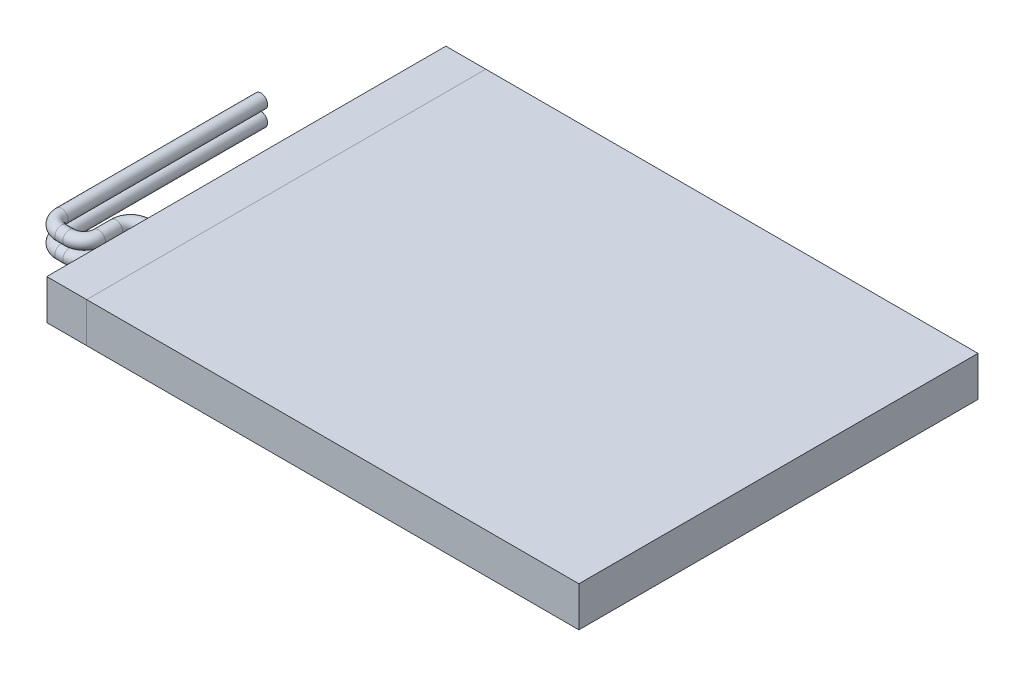
ISO-10303-21;
HEADER;
FILE_DESCRIPTION(('STEP AP214'),'2;1');
FILE_NAME('part.step','',(''),(''),'','','');
FILE_SCHEMA(('AUTOMOTIVE_DESIGN { 1 0 10303 214 1 1 1 1 }'));
ENDSEC;
DATA;
#1=APPLICATION_CONTEXT('core data for automotive mechanical design processes');
#2=APPLICATION_PROTOCOL_DEFINITION('international standard','automotive_design',2000,#1);
#3=PRODUCT_CONTEXT('',#1,'mechanical');
#4=PRODUCT('Part','Part','',(#3));
#5=PRODUCT_RELATED_PRODUCT_CATEGORY('part','',(#4));
#6=PRODUCT_DEFINITION_FORMATION('','',#4);
#7=PRODUCT_DEFINITION_CONTEXT('part definition',#1,'design');
#8=PRODUCT_DEFINITION('design','',#6,#7);
#9=PRODUCT_DEFINITION_SHAPE('','',#8);
#10=(LENGTH_UNIT() NAMED_UNIT(*) SI_UNIT(.MILLI.,.METRE.));
#11=(NAMED_UNIT(*) PLANE_ANGLE_UNIT() SI_UNIT($,.RADIAN.));
#12=(NAMED_UNIT(*) SI_UNIT($,.STERADIAN.) SOLID_ANGLE_UNIT());
#13=UNCERTAINTY_MEASURE_WITH_UNIT(LENGTH_MEASURE(1.E-05),#10,'distance_accuracy_value','');
#14=(GEOMETRIC_REPRESENTATION_CONTEXT(3) GLOBAL_UNCERTAINTY_ASSIGNED_CONTEXT((#13)) GLOBAL_UNIT_ASSIGNED_CONTEXT((#10,
#11,#12)) REPRESENTATION_CONTEXT('',''));
#15=CARTESIAN_POINT('',(0.,0.,0.));
#16=DIRECTION('',(0.,0.,1.));
#17=DIRECTION('',(1.,0.,0.));
#18=AXIS2_PLACEMENT_3D('',#15,#16,#17);
#19=CARTESIAN_POINT('',(-20.,-0.01,-15.));
#20=DIRECTION('',(-1.,0.,0.));
#21=DIRECTION('',(0.,0.,1.));
#22=AXIS2_PLACEMENT_3D('',#19,#20,#21);
#23=PLANE('',#22);
#24=CARTESIAN_POINT('',(-20.,1.2,7.5));
#25=DIRECTION('',(-1.,0.,0.));
#26=DIRECTION('',(0.,0.,1.));
#27=AXIS2_PLACEMENT_3D('',#24,#25,#26);
#28=CIRCLE('',#27,0.500000000000001);
#29=CARTESIAN_POINT('',(-20.,1.2,8.));
#30=VERTEX_POINT('',#29);
#31=EDGE_CURVE('E58',#30,#30,#28,.T.);
#32=ORIENTED_EDGE('',*,*,#31,.F.);
#33=EDGE_LOOP('',(#32));
#34=FACE_BOUND('',#33,.T.);
#35=ADVANCED_FACE('F55',(#34),#23,.F.);
#36=CARTESIAN_POINT('',(-24.,1.2,-5.1));
#37=DIRECTION('',(0.,0.,-1.));
#38=DIRECTION('',(-1.,0.,0.));
#39=AXIS2_PLACEMENT_3D('',#36,#37,#38);
#40=PLANE('',#39);
#41=CARTESIAN_POINT('',(-24.,1.2,-5.1));
#42=DIRECTION('',(0.,0.,-1.));
#43=DIRECTION('',(-1.,0.,0.));
#44=AXIS2_PLACEMENT_3D('',#41,#42,#43);
#45=CIRCLE('',#44,0.500000000000001);
#46=CARTESIAN_POINT('',(-24.5,1.2,-5.1));
#47=VERTEX_POINT('',#46);
#48=EDGE_CURVE('E80',#47,#47,#45,.T.);
#49=ORIENTED_EDGE('',*,*,#48,.T.);
#50=EDGE_LOOP('',(#49));
#51=FACE_BOUND('',#50,.T.);
#52=ADVANCED_FACE('F90',(#51),#40,.T.);
#53=CARTESIAN_POINT('',(-24.,1.2,9.9));
#54=DIRECTION('',(0.,0.,-1.));
#55=DIRECTION('',(-1.,0.,0.));
#56=AXIS2_PLACEMENT_3D('',#53,#54,#55);
#57=CYLINDRICAL_SURFACE('',#56,0.500000000000001);
#58=ORIENTED_EDGE('',*,*,#48,.F.);
#59=EDGE_LOOP('',(#58));
#60=FACE_BOUND('',#59,.T.);
#61=CARTESIAN_POINT('',(-24.,1.2,9.9));
#62=DIRECTION('',(0.,0.,-1.));
#63=DIRECTION('',(-1.,0.,0.));
#64=AXIS2_PLACEMENT_3D('',#61,#62,#63);
#65=CIRCLE('',#64,0.500000000000001);
#66=CARTESIAN_POINT('',(-24.5,1.2,9.9));
#67=VERTEX_POINT('',#66);
#68=EDGE_CURVE('E77',#67,#67,#65,.T.);
#69=ORIENTED_EDGE('',*,*,#68,.T.);
#70=EDGE_LOOP('',(#69));
#71=FACE_BOUND('',#70,.T.);
#72=ADVANCED_FACE('F94',(#60,#71),#57,.T.);
#73=CARTESIAN_POINT('',(-22.9,1.2,9.9));
#74=DIRECTION('',(0.,-1.,0.));
#75=DIRECTION('',(0.,0.,-1.));
#76=AXIS2_PLACEMENT_3D('',#73,#74,#75);
#77=TOROIDAL_SURFACE('',#76,1.1,0.500000000000001);
#78=CARTESIAN_POINT('',(-22.9,1.2,10.9999999999999));
#79=DIRECTION('',(-1.,0.,0.));
#80=DIRECTION('',(0.,0.,1.));
#81=AXIS2_PLACEMENT_3D('',#78,#79,#80);
#82=CIRCLE('',#81,0.500000000000001);
#83=CARTESIAN_POINT('',(-22.9,1.2,11.5));
#84=VERTEX_POINT('',#83);
#85=EDGE_CURVE('E74',#84,#84,#82,.T.);
#86=CARTESIAN_POINT('',(-22.9,1.2,9.9));
#87=DIRECTION('',(0.,-1.,0.));
#88=DIRECTION('',(0.,0.,-1.));
#89=AXIS2_PLACEMENT_3D('',#86,#87,#88);
#90=CIRCLE('',#89,1.6);
#91=EDGE_CURVE('',#84,#67,#90,.T.);
#92=ORIENTED_EDGE('',*,*,#85,.T.);
#93=ORIENTED_EDGE('',*,*,#68,.F.);
#94=ORIENTED_EDGE('',*,*,#91,.T.);
#95=ORIENTED_EDGE('',*,*,#91,.F.);
#96=EDGE_LOOP('',(#92,#94,#93,#95));
#97=FACE_BOUND('',#96,.T.);
#98=ADVANCED_FACE('F99',(#97),#77,.T.);
#99=CARTESIAN_POINT('',(-22.3,1.2,10.9999999999999));
#100=DIRECTION('',(-1.,0.,0.));
#101=DIRECTION('',(0.,0.,1.));
#102=AXIS2_PLACEMENT_3D('',#99,#100,#101);
#103=CYLINDRICAL_SURFACE('',#102,0.500000000000001);
#104=ORIENTED_EDGE('',*,*,#85,.F.);
#105=EDGE_LOOP('',(#104));
#106=FACE_BOUND('',#105,.T.);
#107=CARTESIAN_POINT('',(-22.3,1.2,11.));
#108=DIRECTION('',(-1.,0.,0.));
#109=DIRECTION('',(0.,0.,1.));
#110=AXIS2_PLACEMENT_3D('',#107,#108,#109);
#111=CIRCLE('',#110,0.500000000000001);
#112=CARTESIAN_POINT('',(-22.3,1.2,11.5));
#113=VERTEX_POINT('',#112);
#114=EDGE_CURVE('E71',#113,#113,#111,.T.);
#115=ORIENTED_EDGE('',*,*,#114,.T.);
#116=EDGE_LOOP('',(#115));
#117=FACE_BOUND('',#116,.T.);
#118=ADVANCED_FACE('F105',(#106,#117),#103,.T.);
#119=CARTESIAN_POINT('',(-22.3,1.2,9.9));
#120=DIRECTION('',(0.,-1.,0.));
#121=DIRECTION('',(0.,0.,-1.));
#122=AXIS2_PLACEMENT_3D('',#119,#120,#121);
#123=TOROIDAL_SURFACE('',#122,1.1,0.500000000000001);
#124=CARTESIAN_POINT('',(-21.2,1.2,9.9));
#125=DIRECTION('',(0.,0.,1.));
#126=DIRECTION('',(1.,0.,0.));
#127=AXIS2_PLACEMENT_3D('',#124,#125,#126);
#128=CIRCLE('',#127,0.500000000000001);
#129=CARTESIAN_POINT('',(-20.7,1.2,9.9));
#130=VERTEX_POINT('',#129);
#131=EDGE_CURVE('E66',#130,#130,#128,.T.);
#132=CARTESIAN_POINT('',(-22.3,1.2,9.9));
#133=DIRECTION('',(0.,-1.,0.));
#134=DIRECTION('',(0.,0.,-1.));
#135=AXIS2_PLACEMENT_3D('',#132,#133,#134);
#136=CIRCLE('',#135,1.6);
#137=EDGE_CURVE('',#130,#113,#136,.T.);
#138=ORIENTED_EDGE('',*,*,#131,.T.);
#139=ORIENTED_EDGE('',*,*,#114,.F.);
#140=ORIENTED_EDGE('',*,*,#137,.T.);
#141=ORIENTED_EDGE('',*,*,#137,.F.);
#142=EDGE_LOOP('',(#138,#140,#139,#141));
#143=FACE_BOUND('',#142,.T.);
#144=ADVANCED_FACE('F109',(#143),#123,.T.);
#145=CARTESIAN_POINT('',(-21.2,1.2,8.6));
#146=DIRECTION('',(0.,0.,1.));
#147=DIRECTION('',(1.,0.,0.));
#148=AXIS2_PLACEMENT_3D('',#145,#146,#147);
#149=CYLINDRICAL_SURFACE('',#148,0.500000000000001);
#150=ORIENTED_EDGE('',*,*,#131,.F.);
#151=EDGE_LOOP('',(#150));
#152=FACE_BOUND('',#151,.T.);
#153=CARTESIAN_POINT('',(-21.2,1.2,8.6));
#154=DIRECTION('',(0.,0.,1.));
#155=DIRECTION('',(1.,0.,0.));
#156=AXIS2_PLACEMENT_3D('',#153,#154,#155);
#157=CIRCLE('',#156,0.500000000000001);
#158=CARTESIAN_POINT('',(-21.7,1.2,8.6));
#159=VERTEX_POINT('',#158);
#160=EDGE_CURVE('E62',#159,#159,#157,.T.);
#161=ORIENTED_EDGE('',*,*,#160,.T.);
#162=EDGE_LOOP('',(#161));
#163=FACE_BOUND('',#162,.T.);
#164=ADVANCED_FACE('F113',(#152,#163),#149,.T.);
#165=CARTESIAN_POINT('',(-20.1,1.2,8.6));
#166=DIRECTION('',(0.,1.,0.));
#167=DIRECTION('',(0.,0.,1.));
#168=AXIS2_PLACEMENT_3D('',#165,#166,#167);
#169=TOROIDAL_SURFACE('',#168,1.1,0.500000000000001);
#170=CARTESIAN_POINT('',(-20.1,1.2,7.5));
#171=DIRECTION('',(-1.,0.,0.));
#172=DIRECTION('',(0.,0.,1.));
#173=AXIS2_PLACEMENT_3D('',#170,#171,#172);
#174=CIRCLE('',#173,0.500000000000001);
#175=CARTESIAN_POINT('',(-20.1,1.2,7.));
#176=VERTEX_POINT('',#175);
#177=EDGE_CURVE('E13',#176,#176,#174,.T.);
#178=CARTESIAN_POINT('',(-20.1,1.2,8.6));
#179=DIRECTION('',(0.,1.,0.));
#180=DIRECTION('',(0.,0.,1.));
#181=AXIS2_PLACEMENT_3D('',#178,#179,#180);
#182=CIRCLE('',#181,1.6);
#183=EDGE_CURVE('',#176,#159,#182,.T.);
#184=ORIENTED_EDGE('',*,*,#177,.T.);
#185=ORIENTED_EDGE('',*,*,#160,.F.);
#186=ORIENTED_EDGE('',*,*,#183,.T.);
#187=ORIENTED_EDGE('',*,*,#183,.F.);
#188=EDGE_LOOP('',(#184,#186,#185,#187));
#189=FACE_BOUND('',#188,.T.);
#190=ADVANCED_FACE('F117',(#189),#169,.T.);
#191=CARTESIAN_POINT('',(-20.,1.2,7.5));
#192=DIRECTION('',(-1.,0.,0.));
#193=DIRECTION('',(0.,0.,1.));
#194=AXIS2_PLACEMENT_3D('',#191,#192,#193);
#195=CYLINDRICAL_SURFACE('',#194,0.500000000000001);
#196=ORIENTED_EDGE('',*,*,#177,.F.);
#197=EDGE_LOOP('',(#196));
#198=FACE_BOUND('',#197,.T.);
#199=ORIENTED_EDGE('',*,*,#31,.T.);
#200=EDGE_LOOP('',(#199));
#201=FACE_BOUND('',#200,.T.);
#202=ADVANCED_FACE('F87',(#198,#201),#195,.T.);
#203=CLOSED_SHELL('',(#35,#52,#72,#98,#118,#144,#164,#190,#202));
#204=MANIFOLD_SOLID_BREP('B2',#203);
#205=CARTESIAN_POINT('',(-20.,-0.01,-15.));
#206=DIRECTION('',(-1.,0.,0.));
#207=DIRECTION('',(0.,0.,1.));
#208=AXIS2_PLACEMENT_3D('',#205,#206,#207);
#209=PLANE('',#208);
#210=CARTESIAN_POINT('',(-20.,2.4,7.5));
#211=DIRECTION('',(-1.,0.,0.));
#212=DIRECTION('',(0.,0.,1.));
#213=AXIS2_PLACEMENT_3D('',#210,#211,#212);
#214=CIRCLE('',#213,0.5);
#215=CARTESIAN_POINT('',(-20.,2.4,8.));
#216=VERTEX_POINT('',#215);
#217=EDGE_CURVE('E54',#216,#216,#214,.T.);
#218=ORIENTED_EDGE('',*,*,#217,.F.);
#219=EDGE_LOOP('',(#218));
#220=FACE_BOUND('',#219,.T.);
#221=ADVANCED_FACE('F201',(#220),#209,.F.);
#222=CARTESIAN_POINT('',(-24.,2.4,-5.1));
#223=DIRECTION('',(0.,0.,-1.));
#224=DIRECTION('',(-1.,0.,0.));
#225=AXIS2_PLACEMENT_3D('',#222,#223,#224);
#226=PLANE('',#225);
#227=CARTESIAN_POINT('',(-24.,2.4,-5.1));
#228=DIRECTION('',(0.,0.,-1.));
#229=DIRECTION('',(-1.,0.,0.));
#230=AXIS2_PLACEMENT_3D('',#227,#228,#229);
#231=CIRCLE('',#230,0.5);
#232=CARTESIAN_POINT('',(-24.5,2.4,-5.1));
#233=VERTEX_POINT('',#232);
#234=EDGE_CURVE('E229',#233,#233,#231,.T.);
#235=ORIENTED_EDGE('',*,*,#234,.T.);
#236=EDGE_LOOP('',(#235));
#237=FACE_BOUND('',#236,.T.);
#238=ADVANCED_FACE('F233',(#237),#226,.T.);
#239=CARTESIAN_POINT('',(-24.,2.4,9.9));
#240=DIRECTION('',(0.,0.,-1.));
#241=DIRECTION('',(-1.,0.,0.));
#242=AXIS2_PLACEMENT_3D('',#239,#240,#241);
#243=CYLINDRICAL_SURFACE('',#242,0.5);
#244=ORIENTED_EDGE('',*,*,#234,.F.);
#245=EDGE_LOOP('',(#244));
#246=FACE_BOUND('',#245,.T.);
#247=CARTESIAN_POINT('',(-24.,2.4,9.9));
#248=DIRECTION('',(0.,0.,-1.));
#249=DIRECTION('',(-1.,0.,0.));
#250=AXIS2_PLACEMENT_3D('',#247,#248,#249);
#251=CIRCLE('',#250,0.5);
#252=CARTESIAN_POINT('',(-24.5,2.4,9.9));
#253=VERTEX_POINT('',#252);
#254=EDGE_CURVE('E226',#253,#253,#251,.T.);
#255=ORIENTED_EDGE('',*,*,#254,.T.);
#256=EDGE_LOOP('',(#255));
#257=FACE_BOUND('',#256,.T.);
#258=ADVANCED_FACE('F235',(#246,#257),#243,.T.);
#259=CARTESIAN_POINT('',(-22.9,2.4,9.9));
#260=DIRECTION('',(0.,-1.,0.));
#261=DIRECTION('',(0.,0.,-1.));
#262=AXIS2_PLACEMENT_3D('',#259,#260,#261);
#263=TOROIDAL_SURFACE('',#262,1.1,0.5);
#264=CARTESIAN_POINT('',(-22.9,2.4,11.));
#265=DIRECTION('',(-1.,0.,0.));
#266=DIRECTION('',(0.,0.,1.));
#267=AXIS2_PLACEMENT_3D('',#264,#265,#266);
#268=CIRCLE('',#267,0.5);
#269=CARTESIAN_POINT('',(-22.9,2.4,11.5));
#270=VERTEX_POINT('',#269);
#271=EDGE_CURVE('E223',#270,#270,#268,.T.);
#272=CARTESIAN_POINT('',(-22.9,2.4,9.9));
#273=DIRECTION('',(0.,-1.,0.));
#274=DIRECTION('',(0.,0.,-1.));
#275=AXIS2_PLACEMENT_3D('',#272,#273,#274);
#276=CIRCLE('',#275,1.6);
#277=EDGE_CURVE('',#270,#253,#276,.T.);
#278=ORIENTED_EDGE('',*,*,#271,.T.);
#279=ORIENTED_EDGE('',*,*,#254,.F.);
#280=ORIENTED_EDGE('',*,*,#277,.T.);
#281=ORIENTED_EDGE('',*,*,#277,.F.);
#282=EDGE_LOOP('',(#278,#280,#279,#281));
#283=FACE_BOUND('',#282,.T.);
#284=ADVANCED_FACE('F238',(#283),#263,.T.);
#285=CARTESIAN_POINT('',(-22.3,2.4,11.));
#286=DIRECTION('',(-1.,0.,0.));
#287=DIRECTION('',(0.,0.,1.));
#288=AXIS2_PLACEMENT_3D('',#285,#286,#287);
#289=CYLINDRICAL_SURFACE('',#288,0.5);
#290=ORIENTED_EDGE('',*,*,#271,.F.);
#291=EDGE_LOOP('',(#290));
#292=FACE_BOUND('',#291,.T.);
#293=CARTESIAN_POINT('',(-22.3,2.4,11.));
#294=DIRECTION('',(-1.,0.,0.));
#295=DIRECTION('',(0.,0.,1.));
#296=AXIS2_PLACEMENT_3D('',#293,#294,#295);
#297=CIRCLE('',#296,0.5);
#298=CARTESIAN_POINT('',(-22.3,2.4,11.5));
#299=VERTEX_POINT('',#298);
#300=EDGE_CURVE('E220',#299,#299,#297,.T.);
#301=ORIENTED_EDGE('',*,*,#300,.T.);
#302=EDGE_LOOP('',(#301));
#303=FACE_BOUND('',#302,.T.);
#304=ADVANCED_FACE('F244',(#292,#303),#289,.T.);
#305=CARTESIAN_POINT('',(-22.3,2.4,9.9));
#306=DIRECTION('',(0.,-1.,0.));
#307=DIRECTION('',(0.,0.,-1.));
#308=AXIS2_PLACEMENT_3D('',#305,#306,#307);
#309=TOROIDAL_SURFACE('',#308,1.1,0.5);
#310=CARTESIAN_POINT('',(-21.2,2.4,9.9));
#311=DIRECTION('',(0.,0.,1.));
#312=DIRECTION('',(1.,0.,0.));
#313=AXIS2_PLACEMENT_3D('',#310,#311,#312);
#314=CIRCLE('',#313,0.5);
#315=CARTESIAN_POINT('',(-20.7,2.4,9.9));
#316=VERTEX_POINT('',#315);
#317=EDGE_CURVE('E215',#316,#316,#314,.T.);
#318=CARTESIAN_POINT('',(-22.3,2.4,9.9));
#319=DIRECTION('',(0.,-1.,0.));
#320=DIRECTION('',(0.,0.,-1.));
#321=AXIS2_PLACEMENT_3D('',#318,#319,#320);
#322=CIRCLE('',#321,1.6);
#323=EDGE_CURVE('',#316,#299,#322,.T.);
#324=ORIENTED_EDGE('',*,*,#317,.T.);
#325=ORIENTED_EDGE('',*,*,#300,.F.);
#326=ORIENTED_EDGE('',*,*,#323,.T.);
#327=ORIENTED_EDGE('',*,*,#323,.F.);
#328=EDGE_LOOP('',(#324,#326,#325,#327));
#329=FACE_BOUND('',#328,.T.);
#330=ADVANCED_FACE('F250',(#329),#309,.T.);
#331=CARTESIAN_POINT('',(-21.2,2.4,8.6));
#332=DIRECTION('',(0.,0.,1.));
#333=DIRECTION('',(1.,0.,0.));
#334=AXIS2_PLACEMENT_3D('',#331,#332,#333);
#335=CYLINDRICAL_SURFACE('',#334,0.5);
#336=ORIENTED_EDGE('',*,*,#317,.F.);
#337=EDGE_LOOP('',(#336));
#338=FACE_BOUND('',#337,.T.);
#339=CARTESIAN_POINT('',(-21.2,2.4,8.6));
#340=DIRECTION('',(0.,0.,1.));
#341=DIRECTION('',(1.,0.,0.));
#342=AXIS2_PLACEMENT_3D('',#339,#340,#341);
#343=CIRCLE('',#342,0.5);
#344=CARTESIAN_POINT('',(-21.7,2.4,8.6));
#345=VERTEX_POINT('',#344);
#346=EDGE_CURVE('E211',#345,#345,#343,.T.);
#347=ORIENTED_EDGE('',*,*,#346,.T.);
#348=EDGE_LOOP('',(#347));
#349=FACE_BOUND('',#348,.T.);
#350=ADVANCED_FACE('F256',(#338,#349),#335,.T.);
#351=CARTESIAN_POINT('',(-20.1,2.4,8.6));
#352=DIRECTION('',(0.,1.,0.));
#353=DIRECTION('',(0.,0.,1.));
#354=AXIS2_PLACEMENT_3D('',#351,#352,#353);
#355=TOROIDAL_SURFACE('',#354,1.1,0.5);
#356=CARTESIAN_POINT('',(-20.1,2.4,7.5));
#357=DIRECTION('',(-1.,0.,0.));
#358=DIRECTION('',(0.,0.,1.));
#359=AXIS2_PLACEMENT_3D('',#356,#357,#358);
#360=CIRCLE('',#359,0.5);
#361=CARTESIAN_POINT('',(-20.1,2.4,7.));
#362=VERTEX_POINT('',#361);
#363=EDGE_CURVE('E207',#362,#362,#360,.T.);
#364=CARTESIAN_POINT('',(-20.1,2.4,8.6));
#365=DIRECTION('',(0.,1.,0.));
#366=DIRECTION('',(0.,0.,1.));
#367=AXIS2_PLACEMENT_3D('',#364,#365,#366);
#368=CIRCLE('',#367,1.6);
#369=EDGE_CURVE('',#362,#345,#368,.T.);
#370=ORIENTED_EDGE('',*,*,#363,.T.);
#371=ORIENTED_EDGE('',*,*,#346,.F.);
#372=ORIENTED_EDGE('',*,*,#369,.T.);
#373=ORIENTED_EDGE('',*,*,#369,.F.);
#374=EDGE_LOOP('',(#370,#372,#371,#373));
#375=FACE_BOUND('',#374,.T.);
#376=ADVANCED_FACE('F262',(#375),#355,.T.);
#377=CARTESIAN_POINT('',(-20.,2.4,7.5));
#378=DIRECTION('',(-1.,0.,0.));
#379=DIRECTION('',(0.,0.,1.));
#380=AXIS2_PLACEMENT_3D('',#377,#378,#379);
#381=CYLINDRICAL_SURFACE('',#380,0.5);
#382=ORIENTED_EDGE('',*,*,#363,.F.);
#383=EDGE_LOOP('',(#382));
#384=FACE_BOUND('',#383,.T.);
#385=ORIENTED_EDGE('',*,*,#217,.T.);
#386=EDGE_LOOP('',(#385));
#387=FACE_BOUND('',#386,.T.);
#388=ADVANCED_FACE('F267',(#384,#387),#381,.T.);
#389=CLOSED_SHELL('',(#221,#238,#258,#284,#304,#330,#350,#376,#388));
#390=MANIFOLD_SOLID_BREP('B8',#389);
#391=CARTESIAN_POINT('',(-20.,-0.01,-15.));
#392=DIRECTION('',(-1.,0.,0.));
#393=DIRECTION('',(0.,0.,1.));
#394=AXIS2_PLACEMENT_3D('',#391,#392,#393);
#395=PLANE('',#394);
#396=DIRECTION('',(0.,0.,1.));
#397=VECTOR('',#396,1.);
#398=CARTESIAN_POINT('',(-20.,0.,-15.));
#399=LINE('',#398,#397);
#400=CARTESIAN_POINT('',(-20.,0.,-15.));
#401=VERTEX_POINT('',#400);
#402=CARTESIAN_POINT('',(-20.,0.,15.));
#403=VERTEX_POINT('',#402);
#404=EDGE_CURVE('E199',#401,#403,#399,.T.);
#405=ORIENTED_EDGE('',*,*,#404,.T.);
#406=DIRECTION('',(0.,-1.,0.));
#407=VECTOR('',#406,1.);
#408=CARTESIAN_POINT('',(-20.,3.,15.));
#409=LINE('',#408,#407);
#410=CARTESIAN_POINT('',(-20.,3.,15.));
#411=VERTEX_POINT('',#410);
#412=EDGE_CURVE('E409',#411,#403,#409,.T.);
#413=ORIENTED_EDGE('',*,*,#412,.F.);
#414=DIRECTION('',(0.,0.,1.));
#415=VECTOR('',#414,1.);
#416=CARTESIAN_POINT('',(-20.,3.,-15.));
#417=LINE('',#416,#415);
#418=CARTESIAN_POINT('',(-20.,3.,-15.));
#419=VERTEX_POINT('',#418);
#420=EDGE_CURVE('E391',#419,#411,#417,.T.);
#421=ORIENTED_EDGE('',*,*,#420,.F.);
#422=DIRECTION('',(0.,-1.,0.));
#423=VECTOR('',#422,1.);
#424=CARTESIAN_POINT('',(-20.,3.,-15.));
#425=LINE('',#424,#423);
#426=EDGE_CURVE('E402',#419,#401,#425,.T.);
#427=ORIENTED_EDGE('',*,*,#426,.T.);
#428=EDGE_LOOP('',(#405,#413,#421,#427));
#429=FACE_BOUND('',#428,.T.);
#430=ADVANCED_FACE('F340',(#429),#395,.T.);
#431=CARTESIAN_POINT('',(-17.,-0.01,-15.));
#432=DIRECTION('',(1.,0.,0.));
#433=DIRECTION('',(0.,0.,-1.));
#434=AXIS2_PLACEMENT_3D('',#431,#432,#433);
#435=PLANE('',#434);
#436=DIRECTION('',(0.,-1.,0.));
#437=VECTOR('',#436,1.);
#438=CARTESIAN_POINT('',(-17.,3.,15.));
#439=LINE('',#438,#437);
#440=CARTESIAN_POINT('',(-17.,3.,15.));
#441=VERTEX_POINT('',#440);
#442=CARTESIAN_POINT('',(-17.,0.,15.));
#443=VERTEX_POINT('',#442);
#444=EDGE_CURVE('E394',#441,#443,#439,.T.);
#445=ORIENTED_EDGE('',*,*,#444,.T.);
#446=DIRECTION('',(0.,0.,-1.));
#447=VECTOR('',#446,1.);
#448=CARTESIAN_POINT('',(-17.,0.,0.));
#449=LINE('',#448,#447);
#450=CARTESIAN_POINT('',(-17.,0.,-15.));
#451=VERTEX_POINT('',#450);
#452=EDGE_CURVE('E388',#443,#451,#449,.T.);
#453=ORIENTED_EDGE('',*,*,#452,.T.);
#454=DIRECTION('',(0.,1.,0.));
#455=VECTOR('',#454,1.);
#456=CARTESIAN_POINT('',(-17.,-0.01,-15.));
#457=LINE('',#456,#455);
#458=CARTESIAN_POINT('',(-17.,3.,-15.));
#459=VERTEX_POINT('',#458);
#460=EDGE_CURVE('E392',#451,#459,#457,.T.);
#461=ORIENTED_EDGE('',*,*,#460,.T.);
#462=DIRECTION('',(0.,0.,-1.));
#463=VECTOR('',#462,1.);
#464=CARTESIAN_POINT('',(-17.,3.,0.));
#465=LINE('',#464,#463);
#466=EDGE_CURVE('E376',#441,#459,#465,.T.);
#467=ORIENTED_EDGE('',*,*,#466,.F.);
#468=EDGE_LOOP('',(#445,#453,#461,#467));
#469=FACE_BOUND('',#468,.T.);
#470=ADVANCED_FACE('F396',(#469),#435,.T.);
#471=CARTESIAN_POINT('',(0.,0.,0.));
#472=DIRECTION('',(0.,1.,0.));
#473=DIRECTION('',(0.,0.,1.));
#474=AXIS2_PLACEMENT_3D('',#471,#472,#473);
#475=PLANE('',#474);
#476=ORIENTED_EDGE('',*,*,#452,.F.);
#477=DIRECTION('',(1.,0.,0.));
#478=VECTOR('',#477,1.);
#479=CARTESIAN_POINT('',(-20.,0.,15.));
#480=LINE('',#479,#478);
#481=EDGE_CURVE('E343',#403,#443,#480,.T.);
#482=ORIENTED_EDGE('',*,*,#481,.F.);
#483=ORIENTED_EDGE('',*,*,#404,.F.);
#484=DIRECTION('',(-1.,0.,0.));
#485=VECTOR('',#484,1.);
#486=CARTESIAN_POINT('',(-20.,0.,-15.));
#487=LINE('',#486,#485);
#488=EDGE_CURVE('E384',#451,#401,#487,.T.);
#489=ORIENTED_EDGE('',*,*,#488,.F.);
#490=EDGE_LOOP('',(#476,#482,#483,#489));
#491=FACE_BOUND('',#490,.T.);
#492=ADVANCED_FACE('F386',(#491),#475,.F.);
#493=CARTESIAN_POINT('',(-20.,3.,-15.));
#494=DIRECTION('',(0.,0.,1.));
#495=DIRECTION('',(1.,0.,0.));
#496=AXIS2_PLACEMENT_3D('',#493,#494,#495);
#497=PLANE('',#496);
#498=ORIENTED_EDGE('',*,*,#460,.F.);
#499=ORIENTED_EDGE('',*,*,#488,.T.);
#500=ORIENTED_EDGE('',*,*,#426,.F.);
#501=DIRECTION('',(-1.,0.,0.));
#502=VECTOR('',#501,1.);
#503=CARTESIAN_POINT('',(-20.,3.,-15.));
#504=LINE('',#503,#502);
#505=EDGE_CURVE('E368',#459,#419,#504,.T.);
#506=ORIENTED_EDGE('',*,*,#505,.F.);
#507=EDGE_LOOP('',(#498,#499,#500,#506));
#508=FACE_BOUND('',#507,.T.);
#509=ADVANCED_FACE('F393',(#508),#497,.F.);
#510=CARTESIAN_POINT('',(-20.,3.,15.));
#511=DIRECTION('',(0.,0.,-1.));
#512=DIRECTION('',(-1.,0.,0.));
#513=AXIS2_PLACEMENT_3D('',#510,#511,#512);
#514=PLANE('',#513);
#515=ORIENTED_EDGE('',*,*,#444,.F.);
#516=DIRECTION('',(1.,0.,0.));
#517=VECTOR('',#516,1.);
#518=CARTESIAN_POINT('',(-20.,3.,15.));
#519=LINE('',#518,#517);
#520=EDGE_CURVE('E401',#411,#441,#519,.T.);
#521=ORIENTED_EDGE('',*,*,#520,.F.);
#522=ORIENTED_EDGE('',*,*,#412,.T.);
#523=ORIENTED_EDGE('',*,*,#481,.T.);
#524=EDGE_LOOP('',(#515,#521,#522,#523));
#525=FACE_BOUND('',#524,.T.);
#526=ADVANCED_FACE('F420',(#525),#514,.F.);
#527=CARTESIAN_POINT('',(0.,3.,0.));
#528=DIRECTION('',(0.,1.,0.));
#529=DIRECTION('',(0.,0.,1.));
#530=AXIS2_PLACEMENT_3D('',#527,#528,#529);
#531=PLANE('',#530);
#532=ORIENTED_EDGE('',*,*,#520,.T.);
#533=ORIENTED_EDGE('',*,*,#466,.T.);
#534=ORIENTED_EDGE('',*,*,#505,.T.);
#535=ORIENTED_EDGE('',*,*,#420,.T.);
#536=EDGE_LOOP('',(#532,#533,#534,#535));
#537=FACE_BOUND('',#536,.T.);
#538=ADVANCED_FACE('F418',(#537),#531,.T.);
#539=CLOSED_SHELL('',(#430,#470,#492,#509,#526,#538));
#540=MANIFOLD_SOLID_BREP('B49',#539);
#541=CARTESIAN_POINT('',(-17.,-0.01,-15.));
#542=DIRECTION('',(1.,0.,0.));
#543=DIRECTION('',(0.,0.,-1.));
#544=AXIS2_PLACEMENT_3D('',#541,#542,#543);
#545=PLANE('',#544);
#546=DIRECTION('',(0.,-1.,0.));
#547=VECTOR('',#546,1.);
#548=CARTESIAN_POINT('',(-17.,3.,15.));
#549=LINE('',#548,#547);
#550=CARTESIAN_POINT('',(-17.,3.,15.));
#551=VERTEX_POINT('',#550);
#552=CARTESIAN_POINT('',(-17.,0.,15.));
#553=VERTEX_POINT('',#552);
#554=EDGE_CURVE('E477',#551,#553,#549,.T.);
#555=ORIENTED_EDGE('',*,*,#554,.F.);
#556=DIRECTION('',(0.,0.,-1.));
#557=VECTOR('',#556,1.);
#558=CARTESIAN_POINT('',(-17.,3.,0.));
#559=LINE('',#558,#557);
#560=CARTESIAN_POINT('',(-17.,3.,-15.));
#561=VERTEX_POINT('',#560);
#562=EDGE_CURVE('E338',#551,#561,#559,.T.);
#563=ORIENTED_EDGE('',*,*,#562,.T.);
#564=DIRECTION('',(0.,1.,0.));
#565=VECTOR('',#564,1.);
#566=CARTESIAN_POINT('',(-17.,-0.01,-15.));
#567=LINE('',#566,#565);
#568=CARTESIAN_POINT('',(-17.,0.,-15.));
#569=VERTEX_POINT('',#568);
#570=EDGE_CURVE('E472',#569,#561,#567,.T.);
#571=ORIENTED_EDGE('',*,*,#570,.F.);
#572=DIRECTION('',(0.,0.,-1.));
#573=VECTOR('',#572,1.);
#574=CARTESIAN_POINT('',(-17.,0.,0.));
#575=LINE('',#574,#573);
#576=EDGE_CURVE('E525',#553,#569,#575,.T.);
#577=ORIENTED_EDGE('',*,*,#576,.F.);
#578=EDGE_LOOP('',(#555,#563,#571,#577));
#579=FACE_BOUND('',#578,.T.);
#580=ADVANCED_FACE('F469',(#579),#545,.F.);
#581=CARTESIAN_POINT('',(20.,3.,-15.));
#582=DIRECTION('',(-1.,0.,0.));
#583=DIRECTION('',(0.,0.,1.));
#584=AXIS2_PLACEMENT_3D('',#581,#582,#583);
#585=PLANE('',#584);
#586=DIRECTION('',(0.,0.,-1.));
#587=VECTOR('',#586,1.);
#588=CARTESIAN_POINT('',(20.,0.,-15.));
#589=LINE('',#588,#587);
#590=CARTESIAN_POINT('',(20.,0.,15.));
#591=VERTEX_POINT('',#590);
#592=CARTESIAN_POINT('',(20.,0.,-15.));
#593=VERTEX_POINT('',#592);
#594=EDGE_CURVE('E535',#591,#593,#589,.T.);
#595=ORIENTED_EDGE('',*,*,#594,.T.);
#596=DIRECTION('',(0.,-1.,0.));
#597=VECTOR('',#596,1.);
#598=CARTESIAN_POINT('',(20.,3.,-15.));
#599=LINE('',#598,#597);
#600=CARTESIAN_POINT('',(20.,3.,-15.));
#601=VERTEX_POINT('',#600);
#602=EDGE_CURVE('E526',#601,#593,#599,.T.);
#603=ORIENTED_EDGE('',*,*,#602,.F.);
#604=DIRECTION('',(0.,0.,-1.));
#605=VECTOR('',#604,1.);
#606=CARTESIAN_POINT('',(20.,3.,-15.));
#607=LINE('',#606,#605);
#608=CARTESIAN_POINT('',(20.,3.,15.));
#609=VERTEX_POINT('',#608);
#610=EDGE_CURVE('E512',#609,#601,#607,.T.);
#611=ORIENTED_EDGE('',*,*,#610,.F.);
#612=DIRECTION('',(0.,-1.,0.));
#613=VECTOR('',#612,1.);
#614=CARTESIAN_POINT('',(20.,3.,15.));
#615=LINE('',#614,#613);
#616=EDGE_CURVE('E519',#609,#591,#615,.T.);
#617=ORIENTED_EDGE('',*,*,#616,.T.);
#618=EDGE_LOOP('',(#595,#603,#611,#617));
#619=FACE_BOUND('',#618,.T.);
#620=ADVANCED_FACE('F528',(#619),#585,.F.);
#621=CARTESIAN_POINT('',(-20.,3.,-15.));
#622=DIRECTION('',(0.,0.,1.));
#623=DIRECTION('',(1.,0.,0.));
#624=AXIS2_PLACEMENT_3D('',#621,#622,#623);
#625=PLANE('',#624);
#626=DIRECTION('',(-1.,0.,0.));
#627=VECTOR('',#626,1.);
#628=CARTESIAN_POINT('',(-20.,0.,-15.));
#629=LINE('',#628,#627);
#630=EDGE_CURVE('E516',#593,#569,#629,.T.);
#631=ORIENTED_EDGE('',*,*,#630,.T.);
#632=ORIENTED_EDGE('',*,*,#570,.T.);
#633=DIRECTION('',(-1.,0.,0.));
#634=VECTOR('',#633,1.);
#635=CARTESIAN_POINT('',(-20.,3.,-15.));
#636=LINE('',#635,#634);
#637=EDGE_CURVE('E530',#601,#561,#636,.T.);
#638=ORIENTED_EDGE('',*,*,#637,.F.);
#639=ORIENTED_EDGE('',*,*,#602,.T.);
#640=EDGE_LOOP('',(#631,#632,#638,#639));
#641=FACE_BOUND('',#640,.T.);
#642=ADVANCED_FACE('F543',(#641),#625,.F.);
#643=CARTESIAN_POINT('',(-20.,3.,15.));
#644=DIRECTION('',(0.,0.,-1.));
#645=DIRECTION('',(-1.,0.,0.));
#646=AXIS2_PLACEMENT_3D('',#643,#644,#645);
#647=PLANE('',#646);
#648=DIRECTION('',(1.,0.,0.));
#649=VECTOR('',#648,1.);
#650=CARTESIAN_POINT('',(-20.,3.,15.));
#651=LINE('',#650,#649);
#652=EDGE_CURVE('E508',#551,#609,#651,.T.);
#653=ORIENTED_EDGE('',*,*,#652,.F.);
#654=ORIENTED_EDGE('',*,*,#554,.T.);
#655=DIRECTION('',(1.,0.,0.));
#656=VECTOR('',#655,1.);
#657=CARTESIAN_POINT('',(-20.,0.,15.));
#658=LINE('',#657,#656);
#659=EDGE_CURVE('E522',#553,#591,#658,.T.);
#660=ORIENTED_EDGE('',*,*,#659,.T.);
#661=ORIENTED_EDGE('',*,*,#616,.F.);
#662=EDGE_LOOP('',(#653,#654,#660,#661));
#663=FACE_BOUND('',#662,.T.);
#664=ADVANCED_FACE('F520',(#663),#647,.F.);
#665=CARTESIAN_POINT('',(0.,0.,0.));
#666=DIRECTION('',(0.,1.,0.));
#667=DIRECTION('',(0.,0.,1.));
#668=AXIS2_PLACEMENT_3D('',#665,#666,#667);
#669=PLANE('',#668);
#670=ORIENTED_EDGE('',*,*,#659,.F.);
#671=ORIENTED_EDGE('',*,*,#576,.T.);
#672=ORIENTED_EDGE('',*,*,#630,.F.);
#673=ORIENTED_EDGE('',*,*,#594,.F.);
#674=EDGE_LOOP('',(#670,#671,#672,#673));
#675=FACE_BOUND('',#674,.T.);
#676=ADVANCED_FACE('F541',(#675),#669,.F.);
#677=CARTESIAN_POINT('',(0.,3.,0.));
#678=DIRECTION('',(0.,1.,0.));
#679=DIRECTION('',(0.,0.,1.));
#680=AXIS2_PLACEMENT_3D('',#677,#678,#679);
#681=PLANE('',#680);
#682=ORIENTED_EDGE('',*,*,#562,.F.);
#683=ORIENTED_EDGE('',*,*,#652,.T.);
#684=ORIENTED_EDGE('',*,*,#610,.T.);
#685=ORIENTED_EDGE('',*,*,#637,.T.);
#686=EDGE_LOOP('',(#682,#683,#684,#685));
#687=FACE_BOUND('',#686,.T.);
#688=ADVANCED_FACE('F510',(#687),#681,.T.);
#689=CLOSED_SHELL('',(#580,#620,#642,#664,#676,#688));
#690=MANIFOLD_SOLID_BREP('B193',#689);
#691=ADVANCED_BREP_SHAPE_REPRESENTATION('',(#18,#204,#390,#540,#690),#14);
#692=SHAPE_DEFINITION_REPRESENTATION(#9,#691);
ENDSEC;
END-ISO-10303-21;
